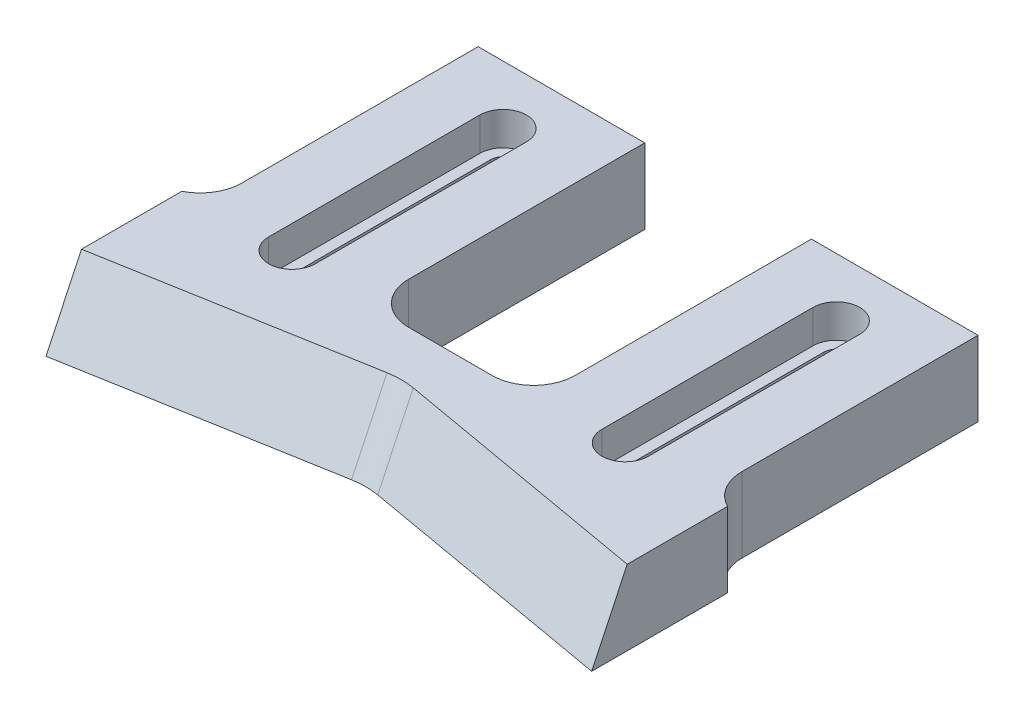
ISO-10303-21;
HEADER;
FILE_DESCRIPTION(('STEP AP214'),'2;1');
FILE_NAME('part.step','',(''),(''),'','','');
FILE_SCHEMA(('AUTOMOTIVE_DESIGN { 1 0 10303 214 1 1 1 1 }'));
ENDSEC;
DATA;
#1=APPLICATION_CONTEXT('core data for automotive mechanical design processes');
#2=APPLICATION_PROTOCOL_DEFINITION('international standard','automotive_design',2000,#1);
#3=PRODUCT_CONTEXT('',#1,'mechanical');
#4=PRODUCT('Part','Part','',(#3));
#5=PRODUCT_RELATED_PRODUCT_CATEGORY('part','',(#4));
#6=PRODUCT_DEFINITION_FORMATION('','',#4);
#7=PRODUCT_DEFINITION_CONTEXT('part definition',#1,'design');
#8=PRODUCT_DEFINITION('design','',#6,#7);
#9=PRODUCT_DEFINITION_SHAPE('','',#8);
#10=(LENGTH_UNIT() NAMED_UNIT(*) SI_UNIT(.MILLI.,.METRE.));
#11=(NAMED_UNIT(*) PLANE_ANGLE_UNIT() SI_UNIT($,.RADIAN.));
#12=(NAMED_UNIT(*) SI_UNIT($,.STERADIAN.) SOLID_ANGLE_UNIT());
#13=UNCERTAINTY_MEASURE_WITH_UNIT(LENGTH_MEASURE(1.E-05),#10,'distance_accuracy_value','');
#14=(GEOMETRIC_REPRESENTATION_CONTEXT(3) GLOBAL_UNCERTAINTY_ASSIGNED_CONTEXT((#13)) GLOBAL_UNIT_ASSIGNED_CONTEXT((#10,
#11,#12)) REPRESENTATION_CONTEXT('',''));
#15=CARTESIAN_POINT('',(0.,0.,0.));
#16=DIRECTION('',(0.,0.,1.));
#17=DIRECTION('',(1.,0.,0.));
#18=AXIS2_PLACEMENT_3D('',#15,#16,#17);
#19=CARTESIAN_POINT('',(57.75,-0.000999999999999265,-43.));
#20=DIRECTION('',(0.,1.,0.));
#21=DIRECTION('',(0.,0.,1.));
#22=AXIS2_PLACEMENT_3D('',#19,#20,#21);
#23=CYLINDRICAL_SURFACE('',#22,1.50000000000001);
#24=CARTESIAN_POINT('',(57.75,5.,-43.));
#25=DIRECTION('',(0.,1.,0.));
#26=DIRECTION('',(0.,0.,1.));
#27=AXIS2_PLACEMENT_3D('',#24,#25,#26);
#28=CIRCLE('',#27,1.50000000000001);
#29=CARTESIAN_POINT('',(56.25,5.,-43.));
#30=VERTEX_POINT('',#29);
#31=CARTESIAN_POINT('',(59.25,5.,-43.));
#32=VERTEX_POINT('',#31);
#33=EDGE_CURVE('E386',#30,#32,#28,.F.);
#34=ORIENTED_EDGE('',*,*,#33,.F.);
#35=DIRECTION('',(0.,1.,0.));
#36=VECTOR('',#35,1.);
#37=CARTESIAN_POINT('',(56.25,-0.000999999999999265,-43.));
#38=LINE('',#37,#36);
#39=CARTESIAN_POINT('',(56.25,0.,-43.));
#40=VERTEX_POINT('',#39);
#41=EDGE_CURVE('E458',#40,#30,#38,.T.);
#42=ORIENTED_EDGE('',*,*,#41,.F.);
#43=CARTESIAN_POINT('',(57.75,0.,-43.));
#44=DIRECTION('',(0.,-1.,0.));
#45=DIRECTION('',(0.,0.,-1.));
#46=AXIS2_PLACEMENT_3D('',#43,#44,#45);
#47=CIRCLE('',#46,1.50000000000001);
#48=CARTESIAN_POINT('',(59.25,0.,-43.));
#49=VERTEX_POINT('',#48);
#50=EDGE_CURVE('E455',#49,#40,#47,.F.);
#51=ORIENTED_EDGE('',*,*,#50,.F.);
#52=DIRECTION('',(0.,1.,0.));
#53=VECTOR('',#52,1.);
#54=CARTESIAN_POINT('',(59.25,-0.000999999999999265,-43.));
#55=LINE('',#54,#53);
#56=EDGE_CURVE('E459',#49,#32,#55,.T.);
#57=ORIENTED_EDGE('',*,*,#56,.T.);
#58=EDGE_LOOP('',(#34,#42,#51,#57));
#59=FACE_BOUND('',#58,.T.);
#60=ADVANCED_FACE('F35',(#59),#23,.F.);
#61=CARTESIAN_POINT('',(59.25,-0.000999999999999265,-43.));
#62=DIRECTION('',(1.,0.,0.));
#63=DIRECTION('',(0.,0.,-1.));
#64=AXIS2_PLACEMENT_3D('',#61,#62,#63);
#65=PLANE('',#64);
#66=DIRECTION('',(0.,0.,1.));
#67=VECTOR('',#66,1.);
#68=CARTESIAN_POINT('',(59.25,5.,-43.));
#69=LINE('',#68,#67);
#70=CARTESIAN_POINT('',(59.25,5.,-17.6563435217447));
#71=VERTEX_POINT('',#70);
#72=EDGE_CURVE('E384',#32,#71,#69,.T.);
#73=ORIENTED_EDGE('',*,*,#72,.F.);
#74=ORIENTED_EDGE('',*,*,#56,.F.);
#75=DIRECTION('',(0.,0.,-1.));
#76=VECTOR('',#75,1.);
#77=CARTESIAN_POINT('',(59.25,0.,-43.));
#78=LINE('',#77,#76);
#79=CARTESIAN_POINT('',(59.25,0.,-17.6563435217447));
#80=VERTEX_POINT('',#79);
#81=EDGE_CURVE('E452',#80,#49,#78,.T.);
#82=ORIENTED_EDGE('',*,*,#81,.F.);
#83=DIRECTION('',(0.,1.,0.));
#84=VECTOR('',#83,1.);
#85=CARTESIAN_POINT('',(59.25,-0.000999999999999265,-17.6563435217447));
#86=LINE('',#85,#84);
#87=EDGE_CURVE('E463',#80,#71,#86,.T.);
#88=ORIENTED_EDGE('',*,*,#87,.T.);
#89=EDGE_LOOP('',(#73,#74,#82,#88));
#90=FACE_BOUND('',#89,.T.);
#91=ADVANCED_FACE('F528',(#90),#65,.F.);
#92=CARTESIAN_POINT('',(57.75,-0.000999999999999265,-17.6563435217447));
#93=DIRECTION('',(0.,1.,0.));
#94=DIRECTION('',(0.,0.,1.));
#95=AXIS2_PLACEMENT_3D('',#92,#93,#94);
#96=CYLINDRICAL_SURFACE('',#95,1.5);
#97=CARTESIAN_POINT('',(57.75,5.,-17.6563435217447));
#98=DIRECTION('',(0.,1.,0.));
#99=DIRECTION('',(0.,0.,1.));
#100=AXIS2_PLACEMENT_3D('',#97,#98,#99);
#101=CIRCLE('',#100,1.5);
#102=CARTESIAN_POINT('',(56.25,5.,-17.6563435217447));
#103=VERTEX_POINT('',#102);
#104=EDGE_CURVE('E376',#71,#103,#101,.F.);
#105=ORIENTED_EDGE('',*,*,#104,.F.);
#106=ORIENTED_EDGE('',*,*,#87,.F.);
#107=CARTESIAN_POINT('',(57.75,0.,-17.6563435217447));
#108=DIRECTION('',(0.,-1.,0.));
#109=DIRECTION('',(0.,0.,-1.));
#110=AXIS2_PLACEMENT_3D('',#107,#108,#109);
#111=CIRCLE('',#110,1.5);
#112=CARTESIAN_POINT('',(56.25,0.,-17.6563435217447));
#113=VERTEX_POINT('',#112);
#114=EDGE_CURVE('E447',#113,#80,#111,.F.);
#115=ORIENTED_EDGE('',*,*,#114,.F.);
#116=DIRECTION('',(0.,1.,0.));
#117=VECTOR('',#116,1.);
#118=CARTESIAN_POINT('',(56.25,-0.000999999999999265,-17.6563435217447));
#119=LINE('',#118,#117);
#120=EDGE_CURVE('E466',#113,#103,#119,.T.);
#121=ORIENTED_EDGE('',*,*,#120,.T.);
#122=EDGE_LOOP('',(#105,#106,#115,#121));
#123=FACE_BOUND('',#122,.T.);
#124=ADVANCED_FACE('F534',(#123),#96,.F.);
#125=CARTESIAN_POINT('',(56.25,-0.000999999999999265,-43.));
#126=DIRECTION('',(-1.,0.,0.));
#127=DIRECTION('',(0.,0.,1.));
#128=AXIS2_PLACEMENT_3D('',#125,#126,#127);
#129=PLANE('',#128);
#130=DIRECTION('',(0.,0.,-1.));
#131=VECTOR('',#130,1.);
#132=CARTESIAN_POINT('',(56.25,5.,-43.));
#133=LINE('',#132,#131);
#134=EDGE_CURVE('E325',#103,#30,#133,.T.);
#135=ORIENTED_EDGE('',*,*,#134,.F.);
#136=ORIENTED_EDGE('',*,*,#120,.F.);
#137=DIRECTION('',(0.,0.,1.));
#138=VECTOR('',#137,1.);
#139=CARTESIAN_POINT('',(56.25,0.,-43.));
#140=LINE('',#139,#138);
#141=EDGE_CURVE('E462',#40,#113,#140,.T.);
#142=ORIENTED_EDGE('',*,*,#141,.F.);
#143=ORIENTED_EDGE('',*,*,#41,.T.);
#144=EDGE_LOOP('',(#135,#136,#142,#143));
#145=FACE_BOUND('',#144,.T.);
#146=ADVANCED_FACE('F540',(#145),#129,.F.);
#147=CARTESIAN_POINT('',(17.75,-0.000999999999999265,-43.));
#148=DIRECTION('',(0.,1.,0.));
#149=DIRECTION('',(0.,0.,1.));
#150=AXIS2_PLACEMENT_3D('',#147,#148,#149);
#151=CYLINDRICAL_SURFACE('',#150,1.5);
#152=CARTESIAN_POINT('',(17.75,5.,-43.));
#153=DIRECTION('',(0.,1.,0.));
#154=DIRECTION('',(0.,0.,1.));
#155=AXIS2_PLACEMENT_3D('',#152,#153,#154);
#156=CIRCLE('',#155,1.5);
#157=CARTESIAN_POINT('',(16.25,5.,-43.));
#158=VERTEX_POINT('',#157);
#159=CARTESIAN_POINT('',(19.25,5.,-43.));
#160=VERTEX_POINT('',#159);
#161=EDGE_CURVE('E424',#158,#160,#156,.F.);
#162=ORIENTED_EDGE('',*,*,#161,.F.);
#163=DIRECTION('',(0.,1.,0.));
#164=VECTOR('',#163,1.);
#165=CARTESIAN_POINT('',(16.25,-0.000999999999999265,-43.));
#166=LINE('',#165,#164);
#167=CARTESIAN_POINT('',(16.25,0.,-43.));
#168=VERTEX_POINT('',#167);
#169=EDGE_CURVE('E482',#168,#158,#166,.T.);
#170=ORIENTED_EDGE('',*,*,#169,.F.);
#171=CARTESIAN_POINT('',(17.75,0.,-43.));
#172=DIRECTION('',(0.,-1.,0.));
#173=DIRECTION('',(0.,0.,-1.));
#174=AXIS2_PLACEMENT_3D('',#171,#172,#173);
#175=CIRCLE('',#174,1.5);
#176=CARTESIAN_POINT('',(19.25,0.,-43.));
#177=VERTEX_POINT('',#176);
#178=EDGE_CURVE('E479',#177,#168,#175,.F.);
#179=ORIENTED_EDGE('',*,*,#178,.F.);
#180=DIRECTION('',(0.,1.,0.));
#181=VECTOR('',#180,1.);
#182=CARTESIAN_POINT('',(19.25,-0.000999999999999265,-43.));
#183=LINE('',#182,#181);
#184=EDGE_CURVE('E483',#177,#160,#183,.T.);
#185=ORIENTED_EDGE('',*,*,#184,.T.);
#186=EDGE_LOOP('',(#162,#170,#179,#185));
#187=FACE_BOUND('',#186,.T.);
#188=ADVANCED_FACE('F546',(#187),#151,.F.);
#189=CARTESIAN_POINT('',(19.25,-0.000999999999999265,-43.));
#190=DIRECTION('',(1.,0.,0.));
#191=DIRECTION('',(0.,0.,-1.));
#192=AXIS2_PLACEMENT_3D('',#189,#190,#191);
#193=PLANE('',#192);
#194=DIRECTION('',(0.,0.,1.));
#195=VECTOR('',#194,1.);
#196=CARTESIAN_POINT('',(19.25,5.,-43.));
#197=LINE('',#196,#195);
#198=CARTESIAN_POINT('',(19.25,5.,-17.6563435217447));
#199=VERTEX_POINT('',#198);
#200=EDGE_CURVE('E422',#160,#199,#197,.T.);
#201=ORIENTED_EDGE('',*,*,#200,.F.);
#202=ORIENTED_EDGE('',*,*,#184,.F.);
#203=DIRECTION('',(0.,0.,-1.));
#204=VECTOR('',#203,1.);
#205=CARTESIAN_POINT('',(19.25,0.,-43.));
#206=LINE('',#205,#204);
#207=CARTESIAN_POINT('',(19.25,0.,-17.6563435217447));
#208=VERTEX_POINT('',#207);
#209=EDGE_CURVE('E476',#208,#177,#206,.T.);
#210=ORIENTED_EDGE('',*,*,#209,.F.);
#211=DIRECTION('',(0.,1.,0.));
#212=VECTOR('',#211,1.);
#213=CARTESIAN_POINT('',(19.25,-0.000999999999999265,-17.6563435217447));
#214=LINE('',#213,#212);
#215=EDGE_CURVE('E486',#208,#199,#214,.T.);
#216=ORIENTED_EDGE('',*,*,#215,.T.);
#217=EDGE_LOOP('',(#201,#202,#210,#216));
#218=FACE_BOUND('',#217,.T.);
#219=ADVANCED_FACE('F542',(#218),#193,.F.);
#220=CARTESIAN_POINT('',(17.75,-0.000999999999999265,-17.6563435217447));
#221=DIRECTION('',(0.,1.,0.));
#222=DIRECTION('',(0.,0.,1.));
#223=AXIS2_PLACEMENT_3D('',#220,#221,#222);
#224=CYLINDRICAL_SURFACE('',#223,1.5);
#225=CARTESIAN_POINT('',(17.75,5.,-17.6563435217447));
#226=DIRECTION('',(0.,1.,0.));
#227=DIRECTION('',(0.,0.,1.));
#228=AXIS2_PLACEMENT_3D('',#225,#226,#227);
#229=CIRCLE('',#228,1.5);
#230=CARTESIAN_POINT('',(16.25,5.,-17.6563435217447));
#231=VERTEX_POINT('',#230);
#232=EDGE_CURVE('E414',#199,#231,#229,.F.);
#233=ORIENTED_EDGE('',*,*,#232,.F.);
#234=ORIENTED_EDGE('',*,*,#215,.F.);
#235=CARTESIAN_POINT('',(17.75,0.,-17.6563435217447));
#236=DIRECTION('',(0.,-1.,0.));
#237=DIRECTION('',(0.,0.,-1.));
#238=AXIS2_PLACEMENT_3D('',#235,#236,#237);
#239=CIRCLE('',#238,1.5);
#240=CARTESIAN_POINT('',(16.25,0.,-17.6563435217447));
#241=VERTEX_POINT('',#240);
#242=EDGE_CURVE('E473',#241,#208,#239,.F.);
#243=ORIENTED_EDGE('',*,*,#242,.F.);
#244=DIRECTION('',(0.,1.,0.));
#245=VECTOR('',#244,1.);
#246=CARTESIAN_POINT('',(16.25,-0.000999999999999265,-17.6563435217447));
#247=LINE('',#246,#245);
#248=EDGE_CURVE('E489',#241,#231,#247,.T.);
#249=ORIENTED_EDGE('',*,*,#248,.T.);
#250=EDGE_LOOP('',(#233,#234,#243,#249));
#251=FACE_BOUND('',#250,.T.);
#252=ADVANCED_FACE('F545',(#251),#224,.F.);
#253=CARTESIAN_POINT('',(16.25,-0.000999999999999265,-43.));
#254=DIRECTION('',(-1.,0.,0.));
#255=DIRECTION('',(0.,0.,1.));
#256=AXIS2_PLACEMENT_3D('',#253,#254,#255);
#257=PLANE('',#256);
#258=DIRECTION('',(0.,0.,-1.));
#259=VECTOR('',#258,1.);
#260=CARTESIAN_POINT('',(16.25,5.,-43.));
#261=LINE('',#260,#259);
#262=EDGE_CURVE('E323',#231,#158,#261,.T.);
#263=ORIENTED_EDGE('',*,*,#262,.F.);
#264=ORIENTED_EDGE('',*,*,#248,.F.);
#265=DIRECTION('',(0.,0.,1.));
#266=VECTOR('',#265,1.);
#267=CARTESIAN_POINT('',(16.25,0.,-43.));
#268=LINE('',#267,#266);
#269=EDGE_CURVE('E273',#168,#241,#268,.T.);
#270=ORIENTED_EDGE('',*,*,#269,.F.);
#271=ORIENTED_EDGE('',*,*,#169,.T.);
#272=EDGE_LOOP('',(#263,#264,#270,#271));
#273=FACE_BOUND('',#272,.T.);
#274=ADVANCED_FACE('F550',(#273),#257,.F.);
#275=CARTESIAN_POINT('',(0.,9.,-50.));
#276=DIRECTION('',(0.,0.,1.));
#277=DIRECTION('',(1.,0.,0.));
#278=AXIS2_PLACEMENT_3D('',#275,#276,#277);
#279=PLANE('',#278);
#280=DIRECTION('',(-1.,0.,0.));
#281=VECTOR('',#280,1.);
#282=CARTESIAN_POINT('',(0.,0.,-50.));
#283=LINE('',#282,#281);
#284=CARTESIAN_POINT('',(27.75,0.,-50.));
#285=VERTEX_POINT('',#284);
#286=CARTESIAN_POINT('',(7.74999999999998,0.,-50.));
#287=VERTEX_POINT('',#286);
#288=EDGE_CURVE('E267',#285,#287,#283,.T.);
#289=ORIENTED_EDGE('',*,*,#288,.T.);
#290=DIRECTION('',(0.,1.,0.));
#291=VECTOR('',#290,1.);
#292=CARTESIAN_POINT('',(7.74999999999998,-1.,-50.));
#293=LINE('',#292,#291);
#294=CARTESIAN_POINT('',(7.74999999999998,9.,-50.));
#295=VERTEX_POINT('',#294);
#296=EDGE_CURVE('E433',#287,#295,#293,.T.);
#297=ORIENTED_EDGE('',*,*,#296,.T.);
#298=DIRECTION('',(-1.,0.,0.));
#299=VECTOR('',#298,1.);
#300=CARTESIAN_POINT('',(0.,9.,-50.));
#301=LINE('',#300,#299);
#302=CARTESIAN_POINT('',(27.75,9.,-50.));
#303=VERTEX_POINT('',#302);
#304=EDGE_CURVE('E277',#303,#295,#301,.T.);
#305=ORIENTED_EDGE('',*,*,#304,.F.);
#306=DIRECTION('',(0.,1.,0.));
#307=VECTOR('',#306,1.);
#308=CARTESIAN_POINT('',(27.75,-1.,-50.));
#309=LINE('',#308,#307);
#310=EDGE_CURVE('E445',#285,#303,#309,.T.);
#311=ORIENTED_EDGE('',*,*,#310,.F.);
#312=EDGE_LOOP('',(#289,#297,#305,#311));
#313=FACE_BOUND('',#312,.T.);
#314=ADVANCED_FACE('F507',(#313),#279,.F.);
#315=CARTESIAN_POINT('',(67.75,9.,-50.));
#316=VERTEX_POINT('',#315);
#317=CARTESIAN_POINT('',(47.75,9.,-50.));
#318=VERTEX_POINT('',#317);
#319=EDGE_CURVE('E282',#316,#318,#301,.T.);
#320=ORIENTED_EDGE('',*,*,#319,.F.);
#321=DIRECTION('',(0.,1.,0.));
#322=VECTOR('',#321,1.);
#323=CARTESIAN_POINT('',(67.75,-1.,-50.));
#324=LINE('',#323,#322);
#325=CARTESIAN_POINT('',(67.75,0.,-50.));
#326=VERTEX_POINT('',#325);
#327=EDGE_CURVE('E429',#326,#316,#324,.T.);
#328=ORIENTED_EDGE('',*,*,#327,.F.);
#329=CARTESIAN_POINT('',(47.75,0.,-50.));
#330=VERTEX_POINT('',#329);
#331=EDGE_CURVE('E271',#326,#330,#283,.T.);
#332=ORIENTED_EDGE('',*,*,#331,.T.);
#333=DIRECTION('',(0.,1.,0.));
#334=VECTOR('',#333,1.);
#335=CARTESIAN_POINT('',(47.75,-1.,-50.));
#336=LINE('',#335,#334);
#337=EDGE_CURVE('E444',#330,#318,#336,.T.);
#338=ORIENTED_EDGE('',*,*,#337,.T.);
#339=EDGE_LOOP('',(#320,#328,#332,#338));
#340=FACE_BOUND('',#339,.T.);
#341=ADVANCED_FACE('F560',(#340),#279,.F.);
#342=CARTESIAN_POINT('',(0.,9.,0.));
#343=DIRECTION('',(0.,-1.,0.));
#344=DIRECTION('',(0.,0.,-1.));
#345=AXIS2_PLACEMENT_3D('',#342,#343,#344);
#346=PLANE('',#345);
#347=DIRECTION('',(0.,0.,1.));
#348=VECTOR('',#347,1.);
#349=CARTESIAN_POINT('',(54.95,9.,-43.));
#350=LINE('',#349,#348);
#351=CARTESIAN_POINT('',(54.95,9.,-43.));
#352=VERTEX_POINT('',#351);
#353=CARTESIAN_POINT('',(54.95,9.,-17.6563435217447));
#354=VERTEX_POINT('',#353);
#355=EDGE_CURVE('E366',#352,#354,#350,.T.);
#356=ORIENTED_EDGE('',*,*,#355,.F.);
#357=CARTESIAN_POINT('',(57.75,9.,-43.));
#358=DIRECTION('',(0.,1.,0.));
#359=DIRECTION('',(0.,0.,1.));
#360=AXIS2_PLACEMENT_3D('',#357,#358,#359);
#361=CIRCLE('',#360,2.8);
#362=CARTESIAN_POINT('',(60.55,9.,-43.));
#363=VERTEX_POINT('',#362);
#364=EDGE_CURVE('E350',#363,#352,#361,.T.);
#365=ORIENTED_EDGE('',*,*,#364,.F.);
#366=DIRECTION('',(0.,0.,-1.));
#367=VECTOR('',#366,1.);
#368=CARTESIAN_POINT('',(60.55,9.,-43.));
#369=LINE('',#368,#367);
#370=CARTESIAN_POINT('',(60.55,9.,-17.6563435217447));
#371=VERTEX_POINT('',#370);
#372=EDGE_CURVE('E355',#371,#363,#369,.T.);
#373=ORIENTED_EDGE('',*,*,#372,.F.);
#374=CARTESIAN_POINT('',(57.75,9.,-17.6563435217447));
#375=DIRECTION('',(0.,1.,0.));
#376=DIRECTION('',(0.,0.,1.));
#377=AXIS2_PLACEMENT_3D('',#374,#375,#376);
#378=CIRCLE('',#377,2.79999999999999);
#379=EDGE_CURVE('E369',#354,#371,#378,.T.);
#380=ORIENTED_EDGE('',*,*,#379,.F.);
#381=EDGE_LOOP('',(#356,#365,#373,#380));
#382=FACE_BOUND('',#381,.T.);
#383=DIRECTION('',(0.,0.,1.));
#384=VECTOR('',#383,1.);
#385=CARTESIAN_POINT('',(14.95,9.,-43.));
#386=LINE('',#385,#384);
#387=CARTESIAN_POINT('',(14.95,9.,-43.));
#388=VERTEX_POINT('',#387);
#389=CARTESIAN_POINT('',(14.95,9.,-17.6563435217447));
#390=VERTEX_POINT('',#389);
#391=EDGE_CURVE('E404',#388,#390,#386,.T.);
#392=ORIENTED_EDGE('',*,*,#391,.F.);
#393=CARTESIAN_POINT('',(17.75,9.,-43.));
#394=DIRECTION('',(0.,1.,0.));
#395=DIRECTION('',(0.,0.,1.));
#396=AXIS2_PLACEMENT_3D('',#393,#394,#395);
#397=CIRCLE('',#396,2.8);
#398=CARTESIAN_POINT('',(20.55,9.,-43.));
#399=VERTEX_POINT('',#398);
#400=EDGE_CURVE('E388',#399,#388,#397,.T.);
#401=ORIENTED_EDGE('',*,*,#400,.F.);
#402=DIRECTION('',(0.,0.,-1.));
#403=VECTOR('',#402,1.);
#404=CARTESIAN_POINT('',(20.55,9.,-43.));
#405=LINE('',#404,#403);
#406=CARTESIAN_POINT('',(20.55,9.,-17.6563435217447));
#407=VERTEX_POINT('',#406);
#408=EDGE_CURVE('E393',#407,#399,#405,.T.);
#409=ORIENTED_EDGE('',*,*,#408,.F.);
#410=CARTESIAN_POINT('',(17.75,9.,-17.6563435217447));
#411=DIRECTION('',(0.,1.,0.));
#412=DIRECTION('',(0.,0.,1.));
#413=AXIS2_PLACEMENT_3D('',#410,#411,#412);
#414=CIRCLE('',#413,2.79999999999999);
#415=EDGE_CURVE('E407',#390,#407,#414,.T.);
#416=ORIENTED_EDGE('',*,*,#415,.F.);
#417=EDGE_LOOP('',(#392,#401,#409,#416));
#418=FACE_BOUND('',#417,.T.);
#419=DIRECTION('',(0.984807753012207,0.,0.173648177666935));
#420=VECTOR('',#419,1.);
#421=CARTESIAN_POINT('',(3.00536484096884,9.,-17.0442709839044));
#422=LINE('',#421,#420);
#423=CARTESIAN_POINT('',(39.3237869562427,9.,-10.6403532682224));
#424=VERTEX_POINT('',#423);
#425=CARTESIAN_POINT('',(70.5,9.,-5.14314575229271));
#426=VERTEX_POINT('',#425);
#427=EDGE_CURVE('E329',#424,#426,#422,.T.);
#428=ORIENTED_EDGE('',*,*,#427,.T.);
#429=DIRECTION('',(0.,0.,1.));
#430=VECTOR('',#429,1.);
#431=CARTESIAN_POINT('',(70.5,9.,0.));
#432=LINE('',#431,#430);
#433=CARTESIAN_POINT('',(70.5,9.,-17.1912007468718));
#434=VERTEX_POINT('',#433);
#435=EDGE_CURVE('E50',#434,#426,#432,.T.);
#436=ORIENTED_EDGE('',*,*,#435,.F.);
#437=CARTESIAN_POINT('',(72.75,9.,-21.6563435217447));
#438=DIRECTION('',(0.,-1.,0.));
#439=DIRECTION('',(0.,0.,-1.));
#440=AXIS2_PLACEMENT_3D('',#437,#438,#439);
#441=CIRCLE('',#440,5.);
#442=CARTESIAN_POINT('',(67.75,9.,-21.6563435217447));
#443=VERTEX_POINT('',#442);
#444=EDGE_CURVE('E307',#434,#443,#441,.T.);
#445=ORIENTED_EDGE('',*,*,#444,.T.);
#446=DIRECTION('',(0.,0.,1.));
#447=VECTOR('',#446,1.);
#448=CARTESIAN_POINT('',(67.75,9.,-50.));
#449=LINE('',#448,#447);
#450=EDGE_CURVE('E426',#316,#443,#449,.T.);
#451=ORIENTED_EDGE('',*,*,#450,.F.);
#452=ORIENTED_EDGE('',*,*,#319,.T.);
#453=DIRECTION('',(0.,0.,-1.));
#454=VECTOR('',#453,1.);
#455=CARTESIAN_POINT('',(47.75,9.,-50.));
#456=LINE('',#455,#454);
#457=CARTESIAN_POINT('',(47.75,9.,-21.6563435217447));
#458=VERTEX_POINT('',#457);
#459=EDGE_CURVE('E442',#458,#318,#456,.T.);
#460=ORIENTED_EDGE('',*,*,#459,.F.);
#461=CARTESIAN_POINT('',(42.75,9.,-21.6563435217447));
#462=DIRECTION('',(0.,-1.,0.));
#463=DIRECTION('',(0.,0.,-1.));
#464=AXIS2_PLACEMENT_3D('',#461,#462,#463);
#465=CIRCLE('',#464,5.);
#466=CARTESIAN_POINT('',(42.75,9.,-16.6563435217447));
#467=VERTEX_POINT('',#466);
#468=EDGE_CURVE('E310',#458,#467,#465,.T.);
#469=ORIENTED_EDGE('',*,*,#468,.T.);
#470=DIRECTION('',(1.,0.,0.));
#471=VECTOR('',#470,1.);
#472=CARTESIAN_POINT('',(27.75,9.,-16.6563435217447));
#473=LINE('',#472,#471);
#474=CARTESIAN_POINT('',(32.75,9.,-16.6563435217447));
#475=VERTEX_POINT('',#474);
#476=EDGE_CURVE('E439',#475,#467,#473,.T.);
#477=ORIENTED_EDGE('',*,*,#476,.F.);
#478=CARTESIAN_POINT('',(32.75,9.,-21.6563435217447));
#479=DIRECTION('',(0.,-1.,0.));
#480=DIRECTION('',(0.,0.,-1.));
#481=AXIS2_PLACEMENT_3D('',#478,#479,#480);
#482=CIRCLE('',#481,5.);
#483=CARTESIAN_POINT('',(27.75,9.,-21.6563435217447));
#484=VERTEX_POINT('',#483);
#485=EDGE_CURVE('E314',#475,#484,#482,.T.);
#486=ORIENTED_EDGE('',*,*,#485,.T.);
#487=DIRECTION('',(0.,0.,1.));
#488=VECTOR('',#487,1.);
#489=CARTESIAN_POINT('',(27.75,9.,-50.));
#490=LINE('',#489,#488);
#491=EDGE_CURVE('E436',#303,#484,#490,.T.);
#492=ORIENTED_EDGE('',*,*,#491,.F.);
#493=ORIENTED_EDGE('',*,*,#304,.T.);
#494=DIRECTION('',(0.,0.,-1.));
#495=VECTOR('',#494,1.);
#496=CARTESIAN_POINT('',(7.74999999999998,9.,-50.));
#497=LINE('',#496,#495);
#498=CARTESIAN_POINT('',(7.74999999999999,9.,-21.6563435217447));
#499=VERTEX_POINT('',#498);
#500=EDGE_CURVE('E431',#499,#295,#497,.T.);
#501=ORIENTED_EDGE('',*,*,#500,.F.);
#502=CARTESIAN_POINT('',(2.74999999999999,9.,-21.6563435217447));
#503=DIRECTION('',(0.,-1.,0.));
#504=DIRECTION('',(0.,0.,-1.));
#505=AXIS2_PLACEMENT_3D('',#502,#503,#504);
#506=CIRCLE('',#505,5.);
#507=CARTESIAN_POINT('',(5.,9.,-17.1912007468718));
#508=VERTEX_POINT('',#507);
#509=EDGE_CURVE('E318',#499,#508,#506,.T.);
#510=ORIENTED_EDGE('',*,*,#509,.T.);
#511=DIRECTION('',(0.,0.,-1.));
#512=VECTOR('',#511,1.);
#513=CARTESIAN_POINT('',(5.,9.,0.));
#514=LINE('',#513,#512);
#515=CARTESIAN_POINT('',(5.,9.,-5.1431457522927));
#516=VERTEX_POINT('',#515);
#517=EDGE_CURVE('E348',#516,#508,#514,.T.);
#518=ORIENTED_EDGE('',*,*,#517,.F.);
#519=DIRECTION('',(0.984807753012207,0.,-0.173648177666935));
#520=VECTOR('',#519,1.);
#521=CARTESIAN_POINT('',(-0.728761275636762,9.,-4.13301057336007));
#522=LINE('',#521,#520);
#523=CARTESIAN_POINT('',(36.1762130437574,9.,-10.6403532682224));
#524=VERTEX_POINT('',#523);
#525=EDGE_CURVE('E327',#516,#524,#522,.T.);
#526=ORIENTED_EDGE('',*,*,#525,.T.);
#527=CARTESIAN_POINT('',(37.75,9.,0.286138648321188));
#528=DIRECTION('',(0.,-1.,0.));
#529=DIRECTION('',(0.,0.,-1.));
#530=AXIS2_PLACEMENT_3D('',#527,#528,#529);
#531=ELLIPSE('',#530,11.0643725151093,10.);
#532=EDGE_CURVE('E11',#524,#424,#531,.T.);
#533=ORIENTED_EDGE('',*,*,#532,.T.);
#534=EDGE_LOOP('',(#428,#436,#445,#451,#452,#460,#469,#477,#486,#492,#493,#501,#510,#518,#526,#533));
#535=FACE_BOUND('',#534,.T.);
#536=ADVANCED_FACE('F504',(#382,#418,#535),#346,.F.);
#537=CARTESIAN_POINT('',(0.,0.,0.));
#538=DIRECTION('',(0.,-1.,0.));
#539=DIRECTION('',(0.,0.,-1.));
#540=AXIS2_PLACEMENT_3D('',#537,#538,#539);
#541=PLANE('',#540);
#542=DIRECTION('',(0.,0.,1.));
#543=VECTOR('',#542,1.);
#544=CARTESIAN_POINT('',(70.5,0.,0.));
#545=LINE('',#544,#543);
#546=CARTESIAN_POINT('',(70.5,0.,-17.1912007468718));
#547=VERTEX_POINT('',#546);
#548=CARTESIAN_POINT('',(70.5,0.,-0.88163490354236));
#549=VERTEX_POINT('',#548);
#550=EDGE_CURVE('E243',#547,#549,#545,.T.);
#551=ORIENTED_EDGE('',*,*,#550,.T.);
#552=DIRECTION('',(0.984807753012207,0.,0.173648177666935));
#553=VECTOR('',#552,1.);
#554=CARTESIAN_POINT('',(75.5,0.,0.));
#555=LINE('',#554,#553);
#556=CARTESIAN_POINT('',(39.3237869562427,0.,-6.37884241947208));
#557=VERTEX_POINT('',#556);
#558=EDGE_CURVE('E257',#557,#549,#555,.T.);
#559=ORIENTED_EDGE('',*,*,#558,.F.);
#560=CARTESIAN_POINT('',(37.75,0.,4.54764949707152));
#561=DIRECTION('',(0.,-1.,0.));
#562=DIRECTION('',(0.,0.,-1.));
#563=AXIS2_PLACEMENT_3D('',#560,#561,#562);
#564=ELLIPSE('',#563,11.0643725151093,10.);
#565=CARTESIAN_POINT('',(36.1762130437573,0.,-6.37884241947208));
#566=VERTEX_POINT('',#565);
#567=EDGE_CURVE('E43',#557,#566,#564,.F.);
#568=ORIENTED_EDGE('',*,*,#567,.T.);
#569=DIRECTION('',(0.984807753012207,0.,-0.173648177666935));
#570=VECTOR('',#569,1.);
#571=CARTESIAN_POINT('',(37.75,0.,-6.65634352174472));
#572=LINE('',#571,#570);
#573=CARTESIAN_POINT('',(5.,0.,-0.881634903542356));
#574=VERTEX_POINT('',#573);
#575=EDGE_CURVE('E268',#574,#566,#572,.T.);
#576=ORIENTED_EDGE('',*,*,#575,.F.);
#577=DIRECTION('',(0.,0.,-1.));
#578=VECTOR('',#577,1.);
#579=CARTESIAN_POINT('',(5.,0.,0.));
#580=LINE('',#579,#578);
#581=CARTESIAN_POINT('',(5.,0.,-17.1912007468718));
#582=VERTEX_POINT('',#581);
#583=EDGE_CURVE('E58',#574,#582,#580,.T.);
#584=ORIENTED_EDGE('',*,*,#583,.T.);
#585=CARTESIAN_POINT('',(2.74999999999999,0.,-21.6563435217447));
#586=DIRECTION('',(0.,-1.,0.));
#587=DIRECTION('',(0.,0.,-1.));
#588=AXIS2_PLACEMENT_3D('',#585,#586,#587);
#589=CIRCLE('',#588,5.);
#590=CARTESIAN_POINT('',(7.74999999999999,0.,-21.6563435217447));
#591=VERTEX_POINT('',#590);
#592=EDGE_CURVE('E321',#582,#591,#589,.F.);
#593=ORIENTED_EDGE('',*,*,#592,.T.);
#594=DIRECTION('',(0.,0.,1.));
#595=VECTOR('',#594,1.);
#596=CARTESIAN_POINT('',(7.74999999999999,0.,0.));
#597=LINE('',#596,#595);
#598=EDGE_CURVE('E287',#287,#591,#597,.T.);
#599=ORIENTED_EDGE('',*,*,#598,.F.);
#600=ORIENTED_EDGE('',*,*,#288,.F.);
#601=DIRECTION('',(0.,0.,-1.));
#602=VECTOR('',#601,1.);
#603=CARTESIAN_POINT('',(27.75,0.,0.));
#604=LINE('',#603,#602);
#605=CARTESIAN_POINT('',(27.75,0.,-21.6563435217447));
#606=VERTEX_POINT('',#605);
#607=EDGE_CURVE('E285',#606,#285,#604,.T.);
#608=ORIENTED_EDGE('',*,*,#607,.F.);
#609=CARTESIAN_POINT('',(32.75,0.,-21.6563435217447));
#610=DIRECTION('',(0.,-1.,0.));
#611=DIRECTION('',(0.,0.,-1.));
#612=AXIS2_PLACEMENT_3D('',#609,#610,#611);
#613=CIRCLE('',#612,5.);
#614=CARTESIAN_POINT('',(32.75,0.,-16.6563435217447));
#615=VERTEX_POINT('',#614);
#616=EDGE_CURVE('E316',#606,#615,#613,.F.);
#617=ORIENTED_EDGE('',*,*,#616,.T.);
#618=DIRECTION('',(-1.,0.,0.));
#619=VECTOR('',#618,1.);
#620=CARTESIAN_POINT('',(0.,0.,-16.6563435217447));
#621=LINE('',#620,#619);
#622=CARTESIAN_POINT('',(42.75,0.,-16.6563435217447));
#623=VERTEX_POINT('',#622);
#624=EDGE_CURVE('E278',#623,#615,#621,.T.);
#625=ORIENTED_EDGE('',*,*,#624,.F.);
#626=CARTESIAN_POINT('',(42.75,0.,-21.6563435217447));
#627=DIRECTION('',(0.,-1.,0.));
#628=DIRECTION('',(0.,0.,-1.));
#629=AXIS2_PLACEMENT_3D('',#626,#627,#628);
#630=CIRCLE('',#629,5.);
#631=CARTESIAN_POINT('',(47.75,0.,-21.6563435217447));
#632=VERTEX_POINT('',#631);
#633=EDGE_CURVE('E312',#623,#632,#630,.F.);
#634=ORIENTED_EDGE('',*,*,#633,.T.);
#635=DIRECTION('',(0.,0.,1.));
#636=VECTOR('',#635,1.);
#637=CARTESIAN_POINT('',(47.75,0.,0.));
#638=LINE('',#637,#636);
#639=EDGE_CURVE('E281',#330,#632,#638,.T.);
#640=ORIENTED_EDGE('',*,*,#639,.F.);
#641=ORIENTED_EDGE('',*,*,#331,.F.);
#642=DIRECTION('',(0.,0.,-1.));
#643=VECTOR('',#642,1.);
#644=CARTESIAN_POINT('',(67.75,0.,0.));
#645=LINE('',#644,#643);
#646=CARTESIAN_POINT('',(67.75,0.,-21.6563435217447));
#647=VERTEX_POINT('',#646);
#648=EDGE_CURVE('E290',#647,#326,#645,.T.);
#649=ORIENTED_EDGE('',*,*,#648,.F.);
#650=CARTESIAN_POINT('',(72.75,0.,-21.6563435217447));
#651=DIRECTION('',(0.,-1.,0.));
#652=DIRECTION('',(0.,0.,-1.));
#653=AXIS2_PLACEMENT_3D('',#650,#651,#652);
#654=CIRCLE('',#653,5.);
#655=EDGE_CURVE('E260',#647,#547,#654,.F.);
#656=ORIENTED_EDGE('',*,*,#655,.T.);
#657=EDGE_LOOP('',(#551,#559,#568,#576,#584,#593,#599,#600,#608,#617,#625,#634,#640,#641,#649,#656));
#658=FACE_BOUND('',#657,.T.);
#659=ORIENTED_EDGE('',*,*,#50,.T.);
#660=ORIENTED_EDGE('',*,*,#141,.T.);
#661=ORIENTED_EDGE('',*,*,#114,.T.);
#662=ORIENTED_EDGE('',*,*,#81,.T.);
#663=EDGE_LOOP('',(#659,#660,#661,#662));
#664=FACE_BOUND('',#663,.T.);
#665=ORIENTED_EDGE('',*,*,#178,.T.);
#666=ORIENTED_EDGE('',*,*,#269,.T.);
#667=ORIENTED_EDGE('',*,*,#242,.T.);
#668=ORIENTED_EDGE('',*,*,#209,.T.);
#669=EDGE_LOOP('',(#665,#666,#667,#668));
#670=FACE_BOUND('',#669,.T.);
#671=ADVANCED_FACE('F254',(#658,#664,#670),#541,.T.);
#672=CARTESIAN_POINT('',(27.75,-1.,-50.));
#673=DIRECTION('',(-1.,0.,0.));
#674=DIRECTION('',(0.,0.,1.));
#675=AXIS2_PLACEMENT_3D('',#672,#673,#674);
#676=PLANE('',#675);
#677=ORIENTED_EDGE('',*,*,#491,.T.);
#678=DIRECTION('',(0.,1.,0.));
#679=VECTOR('',#678,1.);
#680=CARTESIAN_POINT('',(27.75,0.,-21.6563435217447));
#681=LINE('',#680,#679);
#682=EDGE_CURVE('E302',#484,#606,#681,.F.);
#683=ORIENTED_EDGE('',*,*,#682,.T.);
#684=ORIENTED_EDGE('',*,*,#607,.T.);
#685=ORIENTED_EDGE('',*,*,#310,.T.);
#686=EDGE_LOOP('',(#677,#683,#684,#685));
#687=FACE_BOUND('',#686,.T.);
#688=ADVANCED_FACE('F564',(#687),#676,.F.);
#689=CARTESIAN_POINT('',(47.75,-1.,-50.));
#690=DIRECTION('',(1.,0.,0.));
#691=DIRECTION('',(0.,0.,-1.));
#692=AXIS2_PLACEMENT_3D('',#689,#690,#691);
#693=PLANE('',#692);
#694=ORIENTED_EDGE('',*,*,#639,.T.);
#695=DIRECTION('',(0.,1.,0.));
#696=VECTOR('',#695,1.);
#697=CARTESIAN_POINT('',(47.75,9.,-21.6563435217447));
#698=LINE('',#697,#696);
#699=EDGE_CURVE('E294',#632,#458,#698,.T.);
#700=ORIENTED_EDGE('',*,*,#699,.T.);
#701=ORIENTED_EDGE('',*,*,#459,.T.);
#702=ORIENTED_EDGE('',*,*,#337,.F.);
#703=EDGE_LOOP('',(#694,#700,#701,#702));
#704=FACE_BOUND('',#703,.T.);
#705=ADVANCED_FACE('F631',(#704),#693,.F.);
#706=CARTESIAN_POINT('',(27.75,-1.,-16.6563435217447));
#707=DIRECTION('',(0.,0.,1.));
#708=DIRECTION('',(1.,0.,0.));
#709=AXIS2_PLACEMENT_3D('',#706,#707,#708);
#710=PLANE('',#709);
#711=ORIENTED_EDGE('',*,*,#476,.T.);
#712=DIRECTION('',(0.,1.,0.));
#713=VECTOR('',#712,1.);
#714=CARTESIAN_POINT('',(42.75,0.,-16.6563435217447));
#715=LINE('',#714,#713);
#716=EDGE_CURVE('E300',#467,#623,#715,.F.);
#717=ORIENTED_EDGE('',*,*,#716,.T.);
#718=ORIENTED_EDGE('',*,*,#624,.T.);
#719=DIRECTION('',(0.,1.,0.));
#720=VECTOR('',#719,1.);
#721=CARTESIAN_POINT('',(32.75,9.,-16.6563435217447));
#722=LINE('',#721,#720);
#723=EDGE_CURVE('E297',#615,#475,#722,.T.);
#724=ORIENTED_EDGE('',*,*,#723,.T.);
#725=EDGE_LOOP('',(#711,#717,#718,#724));
#726=FACE_BOUND('',#725,.T.);
#727=ADVANCED_FACE('F630',(#726),#710,.F.);
#728=CARTESIAN_POINT('',(7.74999999999998,-1.,-50.));
#729=DIRECTION('',(1.,0.,0.));
#730=DIRECTION('',(0.,0.,-1.));
#731=AXIS2_PLACEMENT_3D('',#728,#729,#730);
#732=PLANE('',#731);
#733=ORIENTED_EDGE('',*,*,#598,.T.);
#734=DIRECTION('',(0.,1.,0.));
#735=VECTOR('',#734,1.);
#736=CARTESIAN_POINT('',(7.74999999999999,9.,-21.6563435217447));
#737=LINE('',#736,#735);
#738=EDGE_CURVE('E304',#591,#499,#737,.T.);
#739=ORIENTED_EDGE('',*,*,#738,.T.);
#740=ORIENTED_EDGE('',*,*,#500,.T.);
#741=ORIENTED_EDGE('',*,*,#296,.F.);
#742=EDGE_LOOP('',(#733,#739,#740,#741));
#743=FACE_BOUND('',#742,.T.);
#744=ADVANCED_FACE('F511',(#743),#732,.F.);
#745=CARTESIAN_POINT('',(67.75,-1.,-50.));
#746=DIRECTION('',(-1.,0.,0.));
#747=DIRECTION('',(0.,0.,1.));
#748=AXIS2_PLACEMENT_3D('',#745,#746,#747);
#749=PLANE('',#748);
#750=ORIENTED_EDGE('',*,*,#450,.T.);
#751=DIRECTION('',(0.,1.,0.));
#752=VECTOR('',#751,1.);
#753=CARTESIAN_POINT('',(67.75,0.,-21.6563435217447));
#754=LINE('',#753,#752);
#755=EDGE_CURVE('E292',#443,#647,#754,.F.);
#756=ORIENTED_EDGE('',*,*,#755,.T.);
#757=ORIENTED_EDGE('',*,*,#648,.T.);
#758=ORIENTED_EDGE('',*,*,#327,.T.);
#759=EDGE_LOOP('',(#750,#756,#757,#758));
#760=FACE_BOUND('',#759,.T.);
#761=ADVANCED_FACE('F572',(#760),#749,.F.);
#762=CARTESIAN_POINT('',(72.75,-1.,-21.6563435217447));
#763=DIRECTION('',(0.,-1.,0.));
#764=DIRECTION('',(0.,0.,-1.));
#765=AXIS2_PLACEMENT_3D('',#762,#763,#764);
#766=CYLINDRICAL_SURFACE('',#765,5.);
#767=ORIENTED_EDGE('',*,*,#444,.F.);
#768=DIRECTION('',(0.,-1.,0.));
#769=VECTOR('',#768,1.);
#770=CARTESIAN_POINT('',(70.5,-1.,-17.1912007468718));
#771=LINE('',#770,#769);
#772=EDGE_CURVE('E249',#547,#434,#771,.F.);
#773=ORIENTED_EDGE('',*,*,#772,.F.);
#774=ORIENTED_EDGE('',*,*,#655,.F.);
#775=ORIENTED_EDGE('',*,*,#755,.F.);
#776=EDGE_LOOP('',(#767,#773,#774,#775));
#777=FACE_BOUND('',#776,.T.);
#778=ADVANCED_FACE('F568',(#777),#766,.F.);
#779=CARTESIAN_POINT('',(42.75,-1.,-21.6563435217447));
#780=DIRECTION('',(0.,-1.,0.));
#781=DIRECTION('',(0.,0.,-1.));
#782=AXIS2_PLACEMENT_3D('',#779,#780,#781);
#783=CYLINDRICAL_SURFACE('',#782,5.);
#784=ORIENTED_EDGE('',*,*,#633,.F.);
#785=ORIENTED_EDGE('',*,*,#716,.F.);
#786=ORIENTED_EDGE('',*,*,#468,.F.);
#787=ORIENTED_EDGE('',*,*,#699,.F.);
#788=EDGE_LOOP('',(#784,#785,#786,#787));
#789=FACE_BOUND('',#788,.T.);
#790=ADVANCED_FACE('F571',(#789),#783,.F.);
#791=CARTESIAN_POINT('',(32.75,-1.,-21.6563435217447));
#792=DIRECTION('',(0.,-1.,0.));
#793=DIRECTION('',(0.,0.,-1.));
#794=AXIS2_PLACEMENT_3D('',#791,#792,#793);
#795=CYLINDRICAL_SURFACE('',#794,5.);
#796=ORIENTED_EDGE('',*,*,#616,.F.);
#797=ORIENTED_EDGE('',*,*,#682,.F.);
#798=ORIENTED_EDGE('',*,*,#485,.F.);
#799=ORIENTED_EDGE('',*,*,#723,.F.);
#800=EDGE_LOOP('',(#796,#797,#798,#799));
#801=FACE_BOUND('',#800,.T.);
#802=ADVANCED_FACE('F576',(#801),#795,.F.);
#803=CARTESIAN_POINT('',(2.74999999999999,-1.,-21.6563435217447));
#804=DIRECTION('',(0.,-1.,0.));
#805=DIRECTION('',(0.,0.,-1.));
#806=AXIS2_PLACEMENT_3D('',#803,#804,#805);
#807=CYLINDRICAL_SURFACE('',#806,5.);
#808=ORIENTED_EDGE('',*,*,#592,.F.);
#809=DIRECTION('',(0.,-1.,0.));
#810=VECTOR('',#809,1.);
#811=CARTESIAN_POINT('',(5.,-1.,-17.1912007468718));
#812=LINE('',#811,#810);
#813=EDGE_CURVE('E342',#508,#582,#812,.T.);
#814=ORIENTED_EDGE('',*,*,#813,.F.);
#815=ORIENTED_EDGE('',*,*,#509,.F.);
#816=ORIENTED_EDGE('',*,*,#738,.F.);
#817=EDGE_LOOP('',(#808,#814,#815,#816));
#818=FACE_BOUND('',#817,.T.);
#819=ADVANCED_FACE('F517',(#818),#807,.F.);
#820=CARTESIAN_POINT('',(17.75,5.,-43.));
#821=DIRECTION('',(0.,1.,0.));
#822=DIRECTION('',(0.,0.,1.));
#823=AXIS2_PLACEMENT_3D('',#820,#821,#822);
#824=PLANE('',#823);
#825=CARTESIAN_POINT('',(17.75,5.,-43.));
#826=DIRECTION('',(0.,1.,0.));
#827=DIRECTION('',(0.,0.,1.));
#828=AXIS2_PLACEMENT_3D('',#825,#826,#827);
#829=CIRCLE('',#828,2.8);
#830=CARTESIAN_POINT('',(20.55,5.,-43.));
#831=VERTEX_POINT('',#830);
#832=CARTESIAN_POINT('',(14.95,5.,-43.));
#833=VERTEX_POINT('',#832);
#834=EDGE_CURVE('E389',#831,#833,#829,.T.);
#835=ORIENTED_EDGE('',*,*,#834,.T.);
#836=DIRECTION('',(0.,0.,1.));
#837=VECTOR('',#836,1.);
#838=CARTESIAN_POINT('',(14.95,5.,-43.));
#839=LINE('',#838,#837);
#840=CARTESIAN_POINT('',(14.95,5.,-17.6563435217447));
#841=VERTEX_POINT('',#840);
#842=EDGE_CURVE('E392',#833,#841,#839,.T.);
#843=ORIENTED_EDGE('',*,*,#842,.T.);
#844=CARTESIAN_POINT('',(17.75,5.,-17.6563435217447));
#845=DIRECTION('',(0.,1.,0.));
#846=DIRECTION('',(0.,0.,1.));
#847=AXIS2_PLACEMENT_3D('',#844,#845,#846);
#848=CIRCLE('',#847,2.79999999999999);
#849=CARTESIAN_POINT('',(20.55,5.,-17.6563435217447));
#850=VERTEX_POINT('',#849);
#851=EDGE_CURVE('E396',#841,#850,#848,.T.);
#852=ORIENTED_EDGE('',*,*,#851,.T.);
#853=DIRECTION('',(0.,0.,-1.));
#854=VECTOR('',#853,1.);
#855=CARTESIAN_POINT('',(20.55,5.,-43.));
#856=LINE('',#855,#854);
#857=EDGE_CURVE('E399',#850,#831,#856,.T.);
#858=ORIENTED_EDGE('',*,*,#857,.T.);
#859=EDGE_LOOP('',(#835,#843,#852,#858));
#860=FACE_BOUND('',#859,.T.);
#861=ORIENTED_EDGE('',*,*,#161,.T.);
#862=ORIENTED_EDGE('',*,*,#200,.T.);
#863=ORIENTED_EDGE('',*,*,#232,.T.);
#864=ORIENTED_EDGE('',*,*,#262,.T.);
#865=EDGE_LOOP('',(#861,#862,#863,#864));
#866=FACE_BOUND('',#865,.T.);
#867=ADVANCED_FACE('F583',(#860,#866),#824,.T.);
#868=CARTESIAN_POINT('',(17.75,5.,-43.));
#869=DIRECTION('',(0.,1.,0.));
#870=DIRECTION('',(0.,0.,1.));
#871=AXIS2_PLACEMENT_3D('',#868,#869,#870);
#872=CYLINDRICAL_SURFACE('',#871,2.8);
#873=ORIENTED_EDGE('',*,*,#400,.T.);
#874=DIRECTION('',(0.,1.,0.));
#875=VECTOR('',#874,1.);
#876=CARTESIAN_POINT('',(14.95,5.,-43.));
#877=LINE('',#876,#875);
#878=EDGE_CURVE('E402',#833,#388,#877,.T.);
#879=ORIENTED_EDGE('',*,*,#878,.F.);
#880=ORIENTED_EDGE('',*,*,#834,.F.);
#881=DIRECTION('',(0.,1.,0.));
#882=VECTOR('',#881,1.);
#883=CARTESIAN_POINT('',(20.55,5.,-43.));
#884=LINE('',#883,#882);
#885=EDGE_CURVE('E412',#831,#399,#884,.T.);
#886=ORIENTED_EDGE('',*,*,#885,.T.);
#887=EDGE_LOOP('',(#873,#879,#880,#886));
#888=FACE_BOUND('',#887,.T.);
#889=ADVANCED_FACE('F608',(#888),#872,.F.);
#890=CARTESIAN_POINT('',(20.55,5.,-43.));
#891=DIRECTION('',(1.,0.,0.));
#892=DIRECTION('',(0.,0.,-1.));
#893=AXIS2_PLACEMENT_3D('',#890,#891,#892);
#894=PLANE('',#893);
#895=ORIENTED_EDGE('',*,*,#408,.T.);
#896=ORIENTED_EDGE('',*,*,#885,.F.);
#897=ORIENTED_EDGE('',*,*,#857,.F.);
#898=DIRECTION('',(0.,1.,0.));
#899=VECTOR('',#898,1.);
#900=CARTESIAN_POINT('',(20.55,5.,-17.6563435217447));
#901=LINE('',#900,#899);
#902=EDGE_CURVE('E415',#850,#407,#901,.T.);
#903=ORIENTED_EDGE('',*,*,#902,.T.);
#904=EDGE_LOOP('',(#895,#896,#897,#903));
#905=FACE_BOUND('',#904,.T.);
#906=ADVANCED_FACE('F610',(#905),#894,.F.);
#907=CARTESIAN_POINT('',(17.75,5.,-17.6563435217447));
#908=DIRECTION('',(0.,1.,0.));
#909=DIRECTION('',(0.,0.,1.));
#910=AXIS2_PLACEMENT_3D('',#907,#908,#909);
#911=CYLINDRICAL_SURFACE('',#910,2.79999999999999);
#912=ORIENTED_EDGE('',*,*,#415,.T.);
#913=ORIENTED_EDGE('',*,*,#902,.F.);
#914=ORIENTED_EDGE('',*,*,#851,.F.);
#915=DIRECTION('',(0.,1.,0.));
#916=VECTOR('',#915,1.);
#917=CARTESIAN_POINT('',(14.95,5.,-17.6563435217447));
#918=LINE('',#917,#916);
#919=EDGE_CURVE('E417',#841,#390,#918,.T.);
#920=ORIENTED_EDGE('',*,*,#919,.T.);
#921=EDGE_LOOP('',(#912,#913,#914,#920));
#922=FACE_BOUND('',#921,.T.);
#923=ADVANCED_FACE('F613',(#922),#911,.F.);
#924=CARTESIAN_POINT('',(14.95,5.,-43.));
#925=DIRECTION('',(-1.,0.,0.));
#926=DIRECTION('',(0.,0.,1.));
#927=AXIS2_PLACEMENT_3D('',#924,#925,#926);
#928=PLANE('',#927);
#929=ORIENTED_EDGE('',*,*,#391,.T.);
#930=ORIENTED_EDGE('',*,*,#919,.F.);
#931=ORIENTED_EDGE('',*,*,#842,.F.);
#932=ORIENTED_EDGE('',*,*,#878,.T.);
#933=EDGE_LOOP('',(#929,#930,#931,#932));
#934=FACE_BOUND('',#933,.T.);
#935=ADVANCED_FACE('F617',(#934),#928,.F.);
#936=CARTESIAN_POINT('',(57.75,5.,-43.));
#937=DIRECTION('',(0.,1.,0.));
#938=DIRECTION('',(0.,0.,1.));
#939=AXIS2_PLACEMENT_3D('',#936,#937,#938);
#940=PLANE('',#939);
#941=CARTESIAN_POINT('',(57.75,5.,-43.));
#942=DIRECTION('',(0.,1.,0.));
#943=DIRECTION('',(0.,0.,1.));
#944=AXIS2_PLACEMENT_3D('',#941,#942,#943);
#945=CIRCLE('',#944,2.8);
#946=CARTESIAN_POINT('',(60.55,5.,-43.));
#947=VERTEX_POINT('',#946);
#948=CARTESIAN_POINT('',(54.95,5.,-43.));
#949=VERTEX_POINT('',#948);
#950=EDGE_CURVE('E351',#947,#949,#945,.T.);
#951=ORIENTED_EDGE('',*,*,#950,.T.);
#952=DIRECTION('',(0.,0.,1.));
#953=VECTOR('',#952,1.);
#954=CARTESIAN_POINT('',(54.95,5.,-43.));
#955=LINE('',#954,#953);
#956=CARTESIAN_POINT('',(54.95,5.,-17.6563435217447));
#957=VERTEX_POINT('',#956);
#958=EDGE_CURVE('E354',#949,#957,#955,.T.);
#959=ORIENTED_EDGE('',*,*,#958,.T.);
#960=CARTESIAN_POINT('',(57.75,5.,-17.6563435217447));
#961=DIRECTION('',(0.,1.,0.));
#962=DIRECTION('',(0.,0.,1.));
#963=AXIS2_PLACEMENT_3D('',#960,#961,#962);
#964=CIRCLE('',#963,2.79999999999999);
#965=CARTESIAN_POINT('',(60.55,5.,-17.6563435217447));
#966=VERTEX_POINT('',#965);
#967=EDGE_CURVE('E358',#957,#966,#964,.T.);
#968=ORIENTED_EDGE('',*,*,#967,.T.);
#969=DIRECTION('',(0.,0.,-1.));
#970=VECTOR('',#969,1.);
#971=CARTESIAN_POINT('',(60.55,5.,-43.));
#972=LINE('',#971,#970);
#973=EDGE_CURVE('E361',#966,#947,#972,.T.);
#974=ORIENTED_EDGE('',*,*,#973,.T.);
#975=EDGE_LOOP('',(#951,#959,#968,#974));
#976=FACE_BOUND('',#975,.T.);
#977=ORIENTED_EDGE('',*,*,#33,.T.);
#978=ORIENTED_EDGE('',*,*,#72,.T.);
#979=ORIENTED_EDGE('',*,*,#104,.T.);
#980=ORIENTED_EDGE('',*,*,#134,.T.);
#981=EDGE_LOOP('',(#977,#978,#979,#980));
#982=FACE_BOUND('',#981,.T.);
#983=ADVANCED_FACE('F604',(#976,#982),#940,.T.);
#984=CARTESIAN_POINT('',(57.75,5.,-43.));
#985=DIRECTION('',(0.,1.,0.));
#986=DIRECTION('',(0.,0.,1.));
#987=AXIS2_PLACEMENT_3D('',#984,#985,#986);
#988=CYLINDRICAL_SURFACE('',#987,2.8);
#989=ORIENTED_EDGE('',*,*,#364,.T.);
#990=DIRECTION('',(0.,1.,0.));
#991=VECTOR('',#990,1.);
#992=CARTESIAN_POINT('',(54.95,5.,-43.));
#993=LINE('',#992,#991);
#994=EDGE_CURVE('E364',#949,#352,#993,.T.);
#995=ORIENTED_EDGE('',*,*,#994,.F.);
#996=ORIENTED_EDGE('',*,*,#950,.F.);
#997=DIRECTION('',(0.,1.,0.));
#998=VECTOR('',#997,1.);
#999=CARTESIAN_POINT('',(60.55,5.,-43.));
#1000=LINE('',#999,#998);
#1001=EDGE_CURVE('E374',#947,#363,#1000,.T.);
#1002=ORIENTED_EDGE('',*,*,#1001,.T.);
#1003=EDGE_LOOP('',(#989,#995,#996,#1002));
#1004=FACE_BOUND('',#1003,.T.);
#1005=ADVANCED_FACE('F601',(#1004),#988,.F.);
#1006=CARTESIAN_POINT('',(60.55,5.,-43.));
#1007=DIRECTION('',(1.,0.,0.));
#1008=DIRECTION('',(0.,0.,-1.));
#1009=AXIS2_PLACEMENT_3D('',#1006,#1007,#1008);
#1010=PLANE('',#1009);
#1011=ORIENTED_EDGE('',*,*,#372,.T.);
#1012=ORIENTED_EDGE('',*,*,#1001,.F.);
#1013=ORIENTED_EDGE('',*,*,#973,.F.);
#1014=DIRECTION('',(0.,1.,0.));
#1015=VECTOR('',#1014,1.);
#1016=CARTESIAN_POINT('',(60.55,5.,-17.6563435217447));
#1017=LINE('',#1016,#1015);
#1018=EDGE_CURVE('E377',#966,#371,#1017,.T.);
#1019=ORIENTED_EDGE('',*,*,#1018,.T.);
#1020=EDGE_LOOP('',(#1011,#1012,#1013,#1019));
#1021=FACE_BOUND('',#1020,.T.);
#1022=ADVANCED_FACE('F596',(#1021),#1010,.F.);
#1023=CARTESIAN_POINT('',(57.75,5.,-17.6563435217447));
#1024=DIRECTION('',(0.,1.,0.));
#1025=DIRECTION('',(0.,0.,1.));
#1026=AXIS2_PLACEMENT_3D('',#1023,#1024,#1025);
#1027=CYLINDRICAL_SURFACE('',#1026,2.79999999999999);
#1028=ORIENTED_EDGE('',*,*,#379,.T.);
#1029=ORIENTED_EDGE('',*,*,#1018,.F.);
#1030=ORIENTED_EDGE('',*,*,#967,.F.);
#1031=DIRECTION('',(0.,1.,0.));
#1032=VECTOR('',#1031,1.);
#1033=CARTESIAN_POINT('',(54.95,5.,-17.6563435217447));
#1034=LINE('',#1033,#1032);
#1035=EDGE_CURVE('E379',#957,#354,#1034,.T.);
#1036=ORIENTED_EDGE('',*,*,#1035,.T.);
#1037=EDGE_LOOP('',(#1028,#1029,#1030,#1036));
#1038=FACE_BOUND('',#1037,.T.);
#1039=ADVANCED_FACE('F590',(#1038),#1027,.F.);
#1040=CARTESIAN_POINT('',(54.95,5.,-43.));
#1041=DIRECTION('',(-1.,0.,0.));
#1042=DIRECTION('',(0.,0.,1.));
#1043=AXIS2_PLACEMENT_3D('',#1040,#1041,#1042);
#1044=PLANE('',#1043);
#1045=ORIENTED_EDGE('',*,*,#355,.T.);
#1046=ORIENTED_EDGE('',*,*,#1035,.F.);
#1047=ORIENTED_EDGE('',*,*,#958,.F.);
#1048=ORIENTED_EDGE('',*,*,#994,.T.);
#1049=EDGE_LOOP('',(#1045,#1046,#1047,#1048));
#1050=FACE_BOUND('',#1049,.T.);
#1051=ADVANCED_FACE('F586',(#1050),#1044,.F.);
#1052=CARTESIAN_POINT('',(-0.728761275636762,9.,-4.13301057336007));
#1053=DIRECTION('',(-0.157378695624267,-0.422618261740697,-0.89253893528903));
#1054=DIRECTION('',(0.984807753012207,0.,-0.173648177666935));
#1055=AXIS2_PLACEMENT_3D('',#1052,#1053,#1054);
#1056=PLANE('',#1055);
#1057=DIRECTION('',(0.,0.903801818525555,-0.427951250529659));
#1058=VECTOR('',#1057,1.);
#1059=CARTESIAN_POINT('',(5.,-0.341818355070397,-0.719783500382984));
#1060=LINE('',#1059,#1058);
#1061=EDGE_CURVE('E261',#516,#574,#1060,.F.);
#1062=ORIENTED_EDGE('',*,*,#1061,.T.);
#1063=ORIENTED_EDGE('',*,*,#575,.T.);
#1064=DIRECTION('',(0.,0.903801818525555,-0.427951250529659));
#1065=VECTOR('',#1064,1.);
#1066=CARTESIAN_POINT('',(36.1762130437573,9.1073327417156,-10.6911754508055));
#1067=LINE('',#1066,#1065);
#1068=EDGE_CURVE('E332',#566,#524,#1067,.T.);
#1069=ORIENTED_EDGE('',*,*,#1068,.T.);
#1070=ORIENTED_EDGE('',*,*,#525,.F.);
#1071=EDGE_LOOP('',(#1062,#1063,#1069,#1070));
#1072=FACE_BOUND('',#1071,.T.);
#1073=ADVANCED_FACE('F340',(#1072),#1056,.F.);
#1074=CARTESIAN_POINT('',(3.00536484096883,9.,-17.0442709839044));
#1075=DIRECTION('',(0.157378695624267,-0.422618261740697,-0.89253893528903));
#1076=DIRECTION('',(0.984807753012207,0.,0.173648177666935));
#1077=AXIS2_PLACEMENT_3D('',#1074,#1075,#1076);
#1078=PLANE('',#1077);
#1079=DIRECTION('',(0.,-0.903801818525555,0.427951250529659));
#1080=VECTOR('',#1079,1.);
#1081=CARTESIAN_POINT('',(70.5,-0.341818355070398,-0.719783500382986));
#1082=LINE('',#1081,#1080);
#1083=EDGE_CURVE('E240',#549,#426,#1082,.F.);
#1084=ORIENTED_EDGE('',*,*,#1083,.T.);
#1085=ORIENTED_EDGE('',*,*,#427,.F.);
#1086=DIRECTION('',(0.,0.903801818525555,-0.427951250529659));
#1087=VECTOR('',#1086,1.);
#1088=CARTESIAN_POINT('',(39.3237869562427,0.107332741715586,-6.42966460205512));
#1089=LINE('',#1088,#1087);
#1090=EDGE_CURVE('E266',#424,#557,#1089,.F.);
#1091=ORIENTED_EDGE('',*,*,#1090,.T.);
#1092=ORIENTED_EDGE('',*,*,#558,.T.);
#1093=EDGE_LOOP('',(#1084,#1085,#1091,#1092));
#1094=FACE_BOUND('',#1093,.T.);
#1095=ADVANCED_FACE('F264',(#1094),#1078,.F.);
#1096=CARTESIAN_POINT('',(37.75,15.7031098818973,-2.88779196079778));
#1097=DIRECTION('',(0.,0.903801818525555,-0.427951250529659));
#1098=DIRECTION('',(0.,0.427951250529659,0.903801818525555));
#1099=AXIS2_PLACEMENT_3D('',#1096,#1097,#1098);
#1100=CYLINDRICAL_SURFACE('',#1099,10.);
#1101=ORIENTED_EDGE('',*,*,#532,.F.);
#1102=ORIENTED_EDGE('',*,*,#1068,.F.);
#1103=ORIENTED_EDGE('',*,*,#567,.F.);
#1104=ORIENTED_EDGE('',*,*,#1090,.F.);
#1105=EDGE_LOOP('',(#1101,#1102,#1103,#1104));
#1106=FACE_BOUND('',#1105,.T.);
#1107=ADVANCED_FACE('F37',(#1106),#1100,.F.);
#1108=CARTESIAN_POINT('',(5.,-0.000999999999999265,0.));
#1109=DIRECTION('',(1.,0.,0.));
#1110=DIRECTION('',(0.,0.,-1.));
#1111=AXIS2_PLACEMENT_3D('',#1108,#1109,#1110);
#1112=PLANE('',#1111);
#1113=ORIENTED_EDGE('',*,*,#813,.T.);
#1114=ORIENTED_EDGE('',*,*,#583,.F.);
#1115=ORIENTED_EDGE('',*,*,#1061,.F.);
#1116=ORIENTED_EDGE('',*,*,#517,.T.);
#1117=EDGE_LOOP('',(#1113,#1114,#1115,#1116));
#1118=FACE_BOUND('',#1117,.T.);
#1119=ADVANCED_FACE('F518',(#1118),#1112,.F.);
#1120=CARTESIAN_POINT('',(70.5,-0.000999999999999265,0.));
#1121=DIRECTION('',(-1.,0.,0.));
#1122=DIRECTION('',(0.,0.,1.));
#1123=AXIS2_PLACEMENT_3D('',#1120,#1121,#1122);
#1124=PLANE('',#1123);
#1125=ORIENTED_EDGE('',*,*,#772,.T.);
#1126=ORIENTED_EDGE('',*,*,#435,.T.);
#1127=ORIENTED_EDGE('',*,*,#1083,.F.);
#1128=ORIENTED_EDGE('',*,*,#550,.F.);
#1129=EDGE_LOOP('',(#1125,#1126,#1127,#1128));
#1130=FACE_BOUND('',#1129,.T.);
#1131=ADVANCED_FACE('F242',(#1130),#1124,.F.);
#1132=CLOSED_SHELL('',(#60,#91,#124,#146,#188,#219,#252,#274,#314,#341,#536,#671,#688,#705,#727,
#744,#761,#778,#790,#802,#819,#867,#889,#906,#923,#935,#983,#1005,#1022,#1039,#1051,#1073,#1095,
#1107,#1119,#1131));
#1133=MANIFOLD_SOLID_BREP('B2',#1132);
#1134=ADVANCED_BREP_SHAPE_REPRESENTATION('',(#18,#1133),#14);
#1135=SHAPE_DEFINITION_REPRESENTATION(#9,#1134);
ENDSEC;
END-ISO-10303-21;
